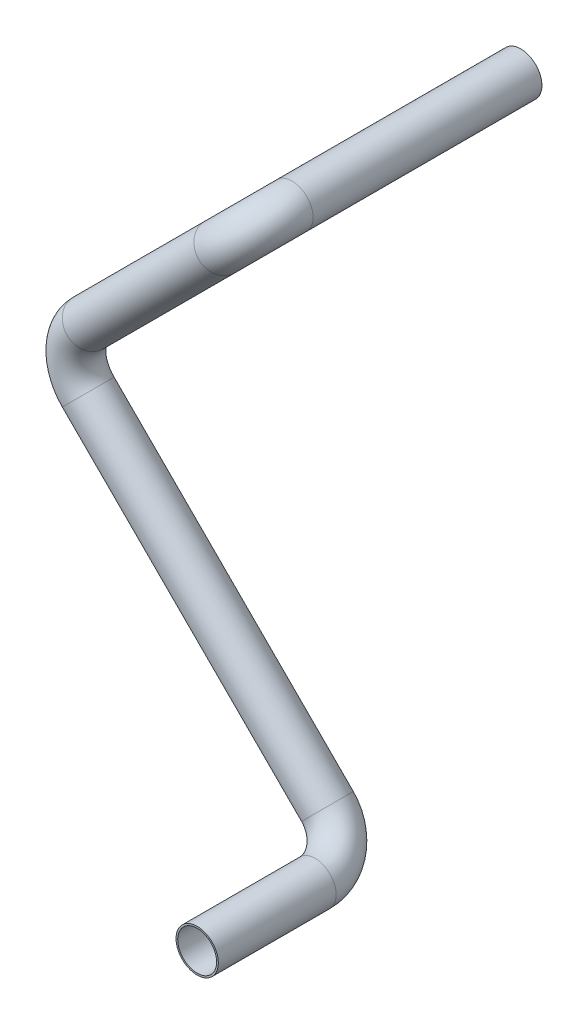
ISO-10303-21;
HEADER;
FILE_DESCRIPTION(('STEP AP214'),'2;1');
FILE_NAME('part.step','',(''),(''),'','','');
FILE_SCHEMA(('AUTOMOTIVE_DESIGN { 1 0 10303 214 1 1 1 1 }'));
ENDSEC;
DATA;
#1=APPLICATION_CONTEXT('core data for automotive mechanical design processes');
#2=APPLICATION_PROTOCOL_DEFINITION('international standard','automotive_design',2000,#1);
#3=PRODUCT_CONTEXT('',#1,'mechanical');
#4=PRODUCT('Part','Part','',(#3));
#5=PRODUCT_RELATED_PRODUCT_CATEGORY('part','',(#4));
#6=PRODUCT_DEFINITION_FORMATION('','',#4);
#7=PRODUCT_DEFINITION_CONTEXT('part definition',#1,'design');
#8=PRODUCT_DEFINITION('design','',#6,#7);
#9=PRODUCT_DEFINITION_SHAPE('','',#8);
#10=(LENGTH_UNIT() NAMED_UNIT(*) SI_UNIT(.MILLI.,.METRE.));
#11=(NAMED_UNIT(*) PLANE_ANGLE_UNIT() SI_UNIT($,.RADIAN.));
#12=(NAMED_UNIT(*) SI_UNIT($,.STERADIAN.) SOLID_ANGLE_UNIT());
#13=UNCERTAINTY_MEASURE_WITH_UNIT(LENGTH_MEASURE(1.E-05),#10,'distance_accuracy_value','');
#14=(GEOMETRIC_REPRESENTATION_CONTEXT(3) GLOBAL_UNCERTAINTY_ASSIGNED_CONTEXT((#13)) GLOBAL_UNIT_ASSIGNED_CONTEXT((#10,
#11,#12)) REPRESENTATION_CONTEXT('',''));
#15=CARTESIAN_POINT('',(0.,0.,0.));
#16=DIRECTION('',(0.,0.,1.));
#17=DIRECTION('',(1.,0.,0.));
#18=AXIS2_PLACEMENT_3D('',#15,#16,#17);
#19=CARTESIAN_POINT('',(32.328922035849,-147.276200385534,94.1121));
#20=DIRECTION('',(0.,0.,1.));
#21=DIRECTION('',(0.,-1.,0.));
#22=AXIS2_PLACEMENT_3D('',#19,#20,#21);
#23=CYLINDRICAL_SURFACE('',#22,6.35);
#24=CARTESIAN_POINT('',(32.328922035849,-147.276200385534,94.1121));
#25=DIRECTION('',(0.,0.,1.));
#26=DIRECTION('',(0.,1.,0.));
#27=AXIS2_PLACEMENT_3D('',#24,#25,#26);
#28=CIRCLE('',#27,6.35);
#29=CARTESIAN_POINT('',(36.8190500963835,-151.766328446069,94.1121));
#30=VERTEX_POINT('',#29);
#31=EDGE_CURVE('E50',#30,#30,#28,.T.);
#32=ORIENTED_EDGE('',*,*,#31,.T.);
#33=EDGE_LOOP('',(#32));
#34=FACE_BOUND('',#33,.T.);
#35=CARTESIAN_POINT('',(32.328922035849,-147.276200385534,129.5121));
#36=DIRECTION('',(0.,0.,1.));
#37=DIRECTION('',(0.,1.,0.));
#38=AXIS2_PLACEMENT_3D('',#35,#36,#37);
#39=CIRCLE('',#38,6.35);
#40=CARTESIAN_POINT('',(32.328922035849,-140.926200385534,129.5121));
#41=VERTEX_POINT('',#40);
#42=EDGE_CURVE('E12',#41,#41,#39,.T.);
#43=ORIENTED_EDGE('',*,*,#42,.F.);
#44=EDGE_LOOP('',(#43));
#45=FACE_BOUND('',#44,.T.);
#46=ADVANCED_FACE('F44',(#34,#45),#23,.T.);
#47=CARTESIAN_POINT('',(23.3486659147798,-138.295944264465,94.1121));
#48=DIRECTION('',(-0.707106781186547,-0.707106781186548,0.));
#49=DIRECTION('',(0.707106781186548,-0.707106781186547,0.));
#50=AXIS2_PLACEMENT_3D('',#47,#48,#49);
#51=TOROIDAL_SURFACE('',#50,12.7,6.35);
#52=CARTESIAN_POINT('',(23.3486659147798,-138.295944264465,81.4121));
#53=DIRECTION('',(0.707106781186545,-0.70710678118655,0.));
#54=DIRECTION('',(0.500000000000002,0.499999999999998,0.707106781186548));
#55=AXIS2_PLACEMENT_3D('',#52,#53,#54);
#56=CIRCLE('',#55,6.35);
#57=CARTESIAN_POINT('',(23.3486659147798,-138.295944264465,75.0621));
#58=VERTEX_POINT('',#57);
#59=EDGE_CURVE('E54',#58,#58,#56,.T.);
#60=CARTESIAN_POINT('',(23.3486659147798,-138.295944264465,94.1121));
#61=DIRECTION('',(-0.707106781186547,-0.707106781186548,0.));
#62=DIRECTION('',(0.707106781186548,-0.707106781186547,0.));
#63=AXIS2_PLACEMENT_3D('',#60,#61,#62);
#64=CIRCLE('',#63,19.05);
#65=EDGE_CURVE('',#58,#30,#64,.T.);
#66=ORIENTED_EDGE('',*,*,#59,.T.);
#67=ORIENTED_EDGE('',*,*,#31,.F.);
#68=ORIENTED_EDGE('',*,*,#65,.T.);
#69=ORIENTED_EDGE('',*,*,#65,.F.);
#70=EDGE_LOOP('',(#66,#68,#67,#69));
#71=FACE_BOUND('',#70,.T.);
#72=ADVANCED_FACE('F124',(#71),#51,.T.);
#73=CARTESIAN_POINT('',(-48.4933830537735,-66.4538952959117,81.4121));
#74=DIRECTION('',(0.707106781186547,-0.707106781186548,0.));
#75=DIRECTION('',(0.707106781186548,0.707106781186547,0.));
#76=AXIS2_PLACEMENT_3D('',#73,#74,#75);
#77=CYLINDRICAL_SURFACE('',#76,6.35);
#78=CARTESIAN_POINT('',(-48.4933830537735,-66.4538952959117,81.4121));
#79=DIRECTION('',(0.707106781186545,-0.70710678118655,0.));
#80=DIRECTION('',(0.500000000000002,0.499999999999998,0.707106781186548));
#81=AXIS2_PLACEMENT_3D('',#78,#79,#80);
#82=CIRCLE('',#81,6.35);
#83=CARTESIAN_POINT('',(-52.9835111143081,-70.9440233564463,81.4121));
#84=VERTEX_POINT('',#83);
#85=EDGE_CURVE('E58',#84,#84,#82,.T.);
#86=ORIENTED_EDGE('',*,*,#85,.T.);
#87=EDGE_LOOP('',(#86));
#88=FACE_BOUND('',#87,.T.);
#89=ORIENTED_EDGE('',*,*,#59,.F.);
#90=EDGE_LOOP('',(#89));
#91=FACE_BOUND('',#90,.T.);
#92=ADVANCED_FACE('F128',(#88,#91),#77,.T.);
#93=CARTESIAN_POINT('',(-39.5131269327043,-57.4736391748426,81.4121));
#94=DIRECTION('',(0.,0.,1.));
#95=DIRECTION('',(1.,0.,0.));
#96=AXIS2_PLACEMENT_3D('',#93,#94,#95);
#97=TOROIDAL_SURFACE('',#96,12.7,6.35);
#98=CARTESIAN_POINT('',(-48.4933830537735,-48.4933830537735,81.4121));
#99=DIRECTION('',(-0.707106781186548,-0.707106781186547,0.));
#100=DIRECTION('',(0.5,-0.5,0.707106781186548));
#101=AXIS2_PLACEMENT_3D('',#98,#99,#100);
#102=CIRCLE('',#101,6.35);
#103=CARTESIAN_POINT('',(-52.9835111143081,-44.0032549932389,81.4121));
#104=VERTEX_POINT('',#103);
#105=EDGE_CURVE('E63',#104,#104,#102,.T.);
#106=CARTESIAN_POINT('',(-39.5131269327043,-57.4736391748426,81.4121));
#107=DIRECTION('',(0.,0.,1.));
#108=DIRECTION('',(1.,0.,0.));
#109=AXIS2_PLACEMENT_3D('',#106,#107,#108);
#110=CIRCLE('',#109,19.05);
#111=EDGE_CURVE('',#104,#84,#110,.T.);
#112=ORIENTED_EDGE('',*,*,#105,.T.);
#113=ORIENTED_EDGE('',*,*,#85,.F.);
#114=ORIENTED_EDGE('',*,*,#111,.T.);
#115=ORIENTED_EDGE('',*,*,#111,.F.);
#116=EDGE_LOOP('',(#112,#114,#113,#115));
#117=FACE_BOUND('',#116,.T.);
#118=ADVANCED_FACE('F134',(#117),#97,.T.);
#119=CARTESIAN_POINT('',(-8.98025612106913,-8.98025612106913,81.4121));
#120=DIRECTION('',(-0.707106781186548,-0.707106781186547,0.));
#121=DIRECTION('',(0.707106781186547,-0.707106781186548,0.));
#122=AXIS2_PLACEMENT_3D('',#119,#120,#121);
#123=CYLINDRICAL_SURFACE('',#122,6.35);
#124=CARTESIAN_POINT('',(-8.98025612106913,-8.98025612106913,81.4121));
#125=DIRECTION('',(-0.707106781186548,-0.707106781186547,0.));
#126=DIRECTION('',(0.5,-0.5,0.707106781186548));
#127=AXIS2_PLACEMENT_3D('',#124,#125,#126);
#128=CIRCLE('',#127,6.35);
#129=CARTESIAN_POINT('',(-8.98025612106913,-8.98025612106913,87.7621));
#130=VERTEX_POINT('',#129);
#131=EDGE_CURVE('E66',#130,#130,#128,.T.);
#132=ORIENTED_EDGE('',*,*,#131,.T.);
#133=EDGE_LOOP('',(#132));
#134=FACE_BOUND('',#133,.T.);
#135=ORIENTED_EDGE('',*,*,#105,.F.);
#136=EDGE_LOOP('',(#135));
#137=FACE_BOUND('',#136,.T.);
#138=ADVANCED_FACE('F141',(#134,#137),#123,.T.);
#139=CARTESIAN_POINT('',(-8.98025612106913,-8.98025612106913,68.7121));
#140=DIRECTION('',(0.707106781186547,-0.707106781186548,0.));
#141=DIRECTION('',(0.707106781186548,0.707106781186547,0.));
#142=AXIS2_PLACEMENT_3D('',#139,#140,#141);
#143=TOROIDAL_SURFACE('',#142,12.7,6.35);
#144=CARTESIAN_POINT('',(0.,0.,68.7121));
#145=DIRECTION('',(0.,0.,1.));
#146=DIRECTION('',(1.,0.,0.));
#147=AXIS2_PLACEMENT_3D('',#144,#145,#146);
#148=CIRCLE('',#147,6.35);
#149=CARTESIAN_POINT('',(4.49012806053458,4.49012806053458,68.7121));
#150=VERTEX_POINT('',#149);
#151=EDGE_CURVE('E69',#150,#150,#148,.T.);
#152=CARTESIAN_POINT('',(-8.98025612106913,-8.98025612106913,68.7121));
#153=DIRECTION('',(0.707106781186547,-0.707106781186548,0.));
#154=DIRECTION('',(0.707106781186548,0.707106781186547,0.));
#155=AXIS2_PLACEMENT_3D('',#152,#153,#154);
#156=CIRCLE('',#155,19.05);
#157=EDGE_CURVE('',#150,#130,#156,.T.);
#158=ORIENTED_EDGE('',*,*,#151,.T.);
#159=ORIENTED_EDGE('',*,*,#131,.F.);
#160=ORIENTED_EDGE('',*,*,#157,.T.);
#161=ORIENTED_EDGE('',*,*,#157,.F.);
#162=EDGE_LOOP('',(#158,#160,#159,#161));
#163=FACE_BOUND('',#162,.T.);
#164=ADVANCED_FACE('F119',(#163),#143,.T.);
#165=CARTESIAN_POINT('',(0.,0.,68.7121));
#166=DIRECTION('',(0.,0.,-1.));
#167=DIRECTION('',(-1.,0.,0.));
#168=AXIS2_PLACEMENT_3D('',#165,#166,#167);
#169=CYLINDRICAL_SURFACE('',#168,6.35);
#170=ORIENTED_EDGE('',*,*,#151,.F.);
#171=EDGE_LOOP('',(#170));
#172=FACE_BOUND('',#171,.T.);
#173=CARTESIAN_POINT('',(0.,0.,0.));
#174=DIRECTION('',(0.,0.,1.));
#175=DIRECTION('',(1.,0.,0.));
#176=AXIS2_PLACEMENT_3D('',#173,#174,#175);
#177=CIRCLE('',#176,6.35);
#178=CARTESIAN_POINT('',(6.35,0.,0.));
#179=VERTEX_POINT('',#178);
#180=EDGE_CURVE('E70',#179,#179,#177,.T.);
#181=ORIENTED_EDGE('',*,*,#180,.T.);
#182=EDGE_LOOP('',(#181));
#183=FACE_BOUND('',#182,.T.);
#184=ADVANCED_FACE('F111',(#172,#183),#169,.T.);
#185=CARTESIAN_POINT('',(32.328922035849,-147.276200385534,129.5121));
#186=DIRECTION('',(0.,0.,1.));
#187=DIRECTION('',(0.,1.,0.));
#188=AXIS2_PLACEMENT_3D('',#185,#186,#187);
#189=PLANE('',#188);
#190=CARTESIAN_POINT('',(32.328922035849,-147.276200385534,129.5121));
#191=DIRECTION('',(0.,0.,1.));
#192=DIRECTION('',(0.,-1.,0.));
#193=AXIS2_PLACEMENT_3D('',#190,#191,#192);
#194=CIRCLE('',#193,5.842);
#195=CARTESIAN_POINT('',(32.328922035849,-153.118200385534,129.5121));
#196=VERTEX_POINT('',#195);
#197=EDGE_CURVE('E73',#196,#196,#194,.T.);
#198=ORIENTED_EDGE('',*,*,#197,.F.);
#199=EDGE_LOOP('',(#198));
#200=FACE_BOUND('',#199,.T.);
#201=ORIENTED_EDGE('',*,*,#42,.T.);
#202=EDGE_LOOP('',(#201));
#203=FACE_BOUND('',#202,.T.);
#204=ADVANCED_FACE('F109',(#200,#203),#189,.T.);
#205=CARTESIAN_POINT('',(0.,0.,0.));
#206=DIRECTION('',(0.,0.,1.));
#207=DIRECTION('',(1.,0.,0.));
#208=AXIS2_PLACEMENT_3D('',#205,#206,#207);
#209=PLANE('',#208);
#210=CARTESIAN_POINT('',(0.,0.,0.));
#211=DIRECTION('',(0.,0.,1.));
#212=DIRECTION('',(1.,0.,0.));
#213=AXIS2_PLACEMENT_3D('',#210,#211,#212);
#214=CIRCLE('',#213,5.842);
#215=CARTESIAN_POINT('',(5.842,0.,0.));
#216=VERTEX_POINT('',#215);
#217=EDGE_CURVE('E76',#216,#216,#214,.T.);
#218=ORIENTED_EDGE('',*,*,#217,.T.);
#219=EDGE_LOOP('',(#218));
#220=FACE_BOUND('',#219,.T.);
#221=ORIENTED_EDGE('',*,*,#180,.F.);
#222=EDGE_LOOP('',(#221));
#223=FACE_BOUND('',#222,.T.);
#224=ADVANCED_FACE('F105',(#220,#223),#209,.F.);
#225=CARTESIAN_POINT('',(32.328922035849,-147.276200385534,94.1121));
#226=DIRECTION('',(0.,0.,1.));
#227=DIRECTION('',(0.,-1.,0.));
#228=AXIS2_PLACEMENT_3D('',#225,#226,#227);
#229=CYLINDRICAL_SURFACE('',#228,5.842);
#230=CARTESIAN_POINT('',(32.328922035849,-147.276200385534,94.1121));
#231=DIRECTION('',(0.,0.,1.));
#232=DIRECTION('',(0.,-1.,0.));
#233=AXIS2_PLACEMENT_3D('',#230,#231,#232);
#234=CIRCLE('',#233,5.842);
#235=CARTESIAN_POINT('',(36.4598398515408,-151.407118201226,94.1121));
#236=VERTEX_POINT('',#235);
#237=EDGE_CURVE('E82',#236,#236,#234,.T.);
#238=ORIENTED_EDGE('',*,*,#237,.F.);
#239=EDGE_LOOP('',(#238));
#240=FACE_BOUND('',#239,.T.);
#241=ORIENTED_EDGE('',*,*,#197,.T.);
#242=EDGE_LOOP('',(#241));
#243=FACE_BOUND('',#242,.T.);
#244=ADVANCED_FACE('F102',(#240,#243),#229,.F.);
#245=CARTESIAN_POINT('',(23.3486659147798,-138.295944264465,94.1121));
#246=DIRECTION('',(-0.707106781186547,-0.707106781186548,0.));
#247=DIRECTION('',(0.707106781186548,-0.707106781186547,0.));
#248=AXIS2_PLACEMENT_3D('',#245,#246,#247);
#249=TOROIDAL_SURFACE('',#248,12.7,5.842);
#250=CARTESIAN_POINT('',(23.3486659147798,-138.295944264465,81.4121));
#251=DIRECTION('',(-0.707106781186548,0.707106781186547,0.));
#252=DIRECTION('',(-0.707106781186547,-0.707106781186548,0.));
#253=AXIS2_PLACEMENT_3D('',#250,#251,#252);
#254=CIRCLE('',#253,5.842);
#255=CARTESIAN_POINT('',(23.3486659147797,-138.295944264465,75.5701));
#256=VERTEX_POINT('',#255);
#257=EDGE_CURVE('E94',#256,#256,#254,.F.);
#258=CARTESIAN_POINT('',(23.3486659147798,-138.295944264465,94.1121));
#259=DIRECTION('',(-0.707106781186547,-0.707106781186548,0.));
#260=DIRECTION('',(0.707106781186548,-0.707106781186547,0.));
#261=AXIS2_PLACEMENT_3D('',#258,#259,#260);
#262=CIRCLE('',#261,18.542);
#263=EDGE_CURVE('',#256,#236,#262,.T.);
#264=ORIENTED_EDGE('',*,*,#257,.F.);
#265=ORIENTED_EDGE('',*,*,#237,.T.);
#266=ORIENTED_EDGE('',*,*,#263,.T.);
#267=ORIENTED_EDGE('',*,*,#263,.F.);
#268=EDGE_LOOP('',(#264,#266,#265,#267));
#269=FACE_BOUND('',#268,.T.);
#270=ADVANCED_FACE('F100',(#269),#249,.F.);
#271=CARTESIAN_POINT('',(-48.4933830537735,-66.4538952959117,81.4121));
#272=DIRECTION('',(0.707106781186547,-0.707106781186548,0.));
#273=DIRECTION('',(0.707106781186548,0.707106781186547,0.));
#274=AXIS2_PLACEMENT_3D('',#271,#272,#273);
#275=CYLINDRICAL_SURFACE('',#274,5.842);
#276=CARTESIAN_POINT('',(-48.4933830537735,-66.4538952959118,81.4121));
#277=DIRECTION('',(0.707106781186547,-0.707106781186548,0.));
#278=DIRECTION('',(0.707106781186548,0.707106781186547,0.));
#279=AXIS2_PLACEMENT_3D('',#276,#277,#278);
#280=CIRCLE('',#279,5.842);
#281=CARTESIAN_POINT('',(-52.6243008694653,-70.5848131116036,81.4121));
#282=VERTEX_POINT('',#281);
#283=EDGE_CURVE('E91',#282,#282,#280,.T.);
#284=ORIENTED_EDGE('',*,*,#283,.F.);
#285=EDGE_LOOP('',(#284));
#286=FACE_BOUND('',#285,.T.);
#287=ORIENTED_EDGE('',*,*,#257,.T.);
#288=EDGE_LOOP('',(#287));
#289=FACE_BOUND('',#288,.T.);
#290=ADVANCED_FACE('F193',(#286,#289),#275,.F.);
#291=CARTESIAN_POINT('',(-39.5131269327043,-57.4736391748426,81.4121));
#292=DIRECTION('',(0.,0.,1.));
#293=DIRECTION('',(1.,0.,0.));
#294=AXIS2_PLACEMENT_3D('',#291,#292,#293);
#295=TOROIDAL_SURFACE('',#294,12.7,5.842);
#296=CARTESIAN_POINT('',(-48.4933830537735,-48.4933830537734,81.4121));
#297=DIRECTION('',(0.707106781186546,0.707106781186549,0.));
#298=DIRECTION('',(-0.707106781186549,0.707106781186546,0.));
#299=AXIS2_PLACEMENT_3D('',#296,#297,#298);
#300=CIRCLE('',#299,5.842);
#301=CARTESIAN_POINT('',(-52.6243008694653,-44.3624652380816,81.4121));
#302=VERTEX_POINT('',#301);
#303=EDGE_CURVE('E88',#302,#302,#300,.F.);
#304=CARTESIAN_POINT('',(-39.5131269327043,-57.4736391748426,81.4121));
#305=DIRECTION('',(0.,0.,1.));
#306=DIRECTION('',(1.,0.,0.));
#307=AXIS2_PLACEMENT_3D('',#304,#305,#306);
#308=CIRCLE('',#307,18.542);
#309=EDGE_CURVE('',#302,#282,#308,.T.);
#310=ORIENTED_EDGE('',*,*,#303,.F.);
#311=ORIENTED_EDGE('',*,*,#283,.T.);
#312=ORIENTED_EDGE('',*,*,#309,.T.);
#313=ORIENTED_EDGE('',*,*,#309,.F.);
#314=EDGE_LOOP('',(#310,#312,#311,#313));
#315=FACE_BOUND('',#314,.T.);
#316=ADVANCED_FACE('F203',(#315),#295,.F.);
#317=CARTESIAN_POINT('',(-8.98025612106913,-8.98025612106913,81.4121));
#318=DIRECTION('',(-0.707106781186548,-0.707106781186547,0.));
#319=DIRECTION('',(0.707106781186547,-0.707106781186548,0.));
#320=AXIS2_PLACEMENT_3D('',#317,#318,#319);
#321=CYLINDRICAL_SURFACE('',#320,5.842);
#322=CARTESIAN_POINT('',(-8.98025612106913,-8.98025612106913,81.4121));
#323=DIRECTION('',(-0.707106781186548,-0.707106781186547,0.));
#324=DIRECTION('',(0.707106781186547,-0.707106781186548,0.));
#325=AXIS2_PLACEMENT_3D('',#322,#323,#324);
#326=CIRCLE('',#325,5.842);
#327=CARTESIAN_POINT('',(-8.98025612106913,-8.98025612106913,87.2541));
#328=VERTEX_POINT('',#327);
#329=EDGE_CURVE('E85',#328,#328,#326,.T.);
#330=ORIENTED_EDGE('',*,*,#329,.F.);
#331=EDGE_LOOP('',(#330));
#332=FACE_BOUND('',#331,.T.);
#333=ORIENTED_EDGE('',*,*,#303,.T.);
#334=EDGE_LOOP('',(#333));
#335=FACE_BOUND('',#334,.T.);
#336=ADVANCED_FACE('F213',(#332,#335),#321,.F.);
#337=CARTESIAN_POINT('',(-8.98025612106913,-8.98025612106913,68.7121));
#338=DIRECTION('',(0.707106781186547,-0.707106781186548,0.));
#339=DIRECTION('',(0.707106781186548,0.707106781186547,0.));
#340=AXIS2_PLACEMENT_3D('',#337,#338,#339);
#341=TOROIDAL_SURFACE('',#340,12.7,5.842);
#342=CARTESIAN_POINT('',(0.,0.,68.7121));
#343=DIRECTION('',(0.,0.,-1.));
#344=DIRECTION('',(-1.,0.,0.));
#345=AXIS2_PLACEMENT_3D('',#342,#343,#344);
#346=CIRCLE('',#345,5.842);
#347=CARTESIAN_POINT('',(4.13091781569181,4.13091781569181,68.7121));
#348=VERTEX_POINT('',#347);
#349=EDGE_CURVE('E79',#348,#348,#346,.F.);
#350=CARTESIAN_POINT('',(-8.98025612106913,-8.98025612106913,68.7121));
#351=DIRECTION('',(0.707106781186547,-0.707106781186548,0.));
#352=DIRECTION('',(0.707106781186548,0.707106781186547,0.));
#353=AXIS2_PLACEMENT_3D('',#350,#351,#352);
#354=CIRCLE('',#353,18.542);
#355=EDGE_CURVE('',#348,#328,#354,.T.);
#356=ORIENTED_EDGE('',*,*,#349,.F.);
#357=ORIENTED_EDGE('',*,*,#329,.T.);
#358=ORIENTED_EDGE('',*,*,#355,.T.);
#359=ORIENTED_EDGE('',*,*,#355,.F.);
#360=EDGE_LOOP('',(#356,#358,#357,#359));
#361=FACE_BOUND('',#360,.T.);
#362=ADVANCED_FACE('F223',(#361),#341,.F.);
#363=CARTESIAN_POINT('',(0.,0.,68.7121));
#364=DIRECTION('',(0.,0.,-1.));
#365=DIRECTION('',(-1.,0.,0.));
#366=AXIS2_PLACEMENT_3D('',#363,#364,#365);
#367=CYLINDRICAL_SURFACE('',#366,5.842);
#368=ORIENTED_EDGE('',*,*,#349,.T.);
#369=EDGE_LOOP('',(#368));
#370=FACE_BOUND('',#369,.T.);
#371=ORIENTED_EDGE('',*,*,#217,.F.);
#372=EDGE_LOOP('',(#371));
#373=FACE_BOUND('',#372,.T.);
#374=ADVANCED_FACE('F233',(#370,#373),#367,.F.);
#375=CLOSED_SHELL('',(#46,#72,#92,#118,#138,#164,#184,#204,#224,#244,#270,#290,#316,#336,#362,#374));
#376=MANIFOLD_SOLID_BREP('B2',#375);
#377=ADVANCED_BREP_SHAPE_REPRESENTATION('',(#18,#376),#14);
#378=SHAPE_DEFINITION_REPRESENTATION(#9,#377);
ENDSEC;
END-ISO-10303-21;
